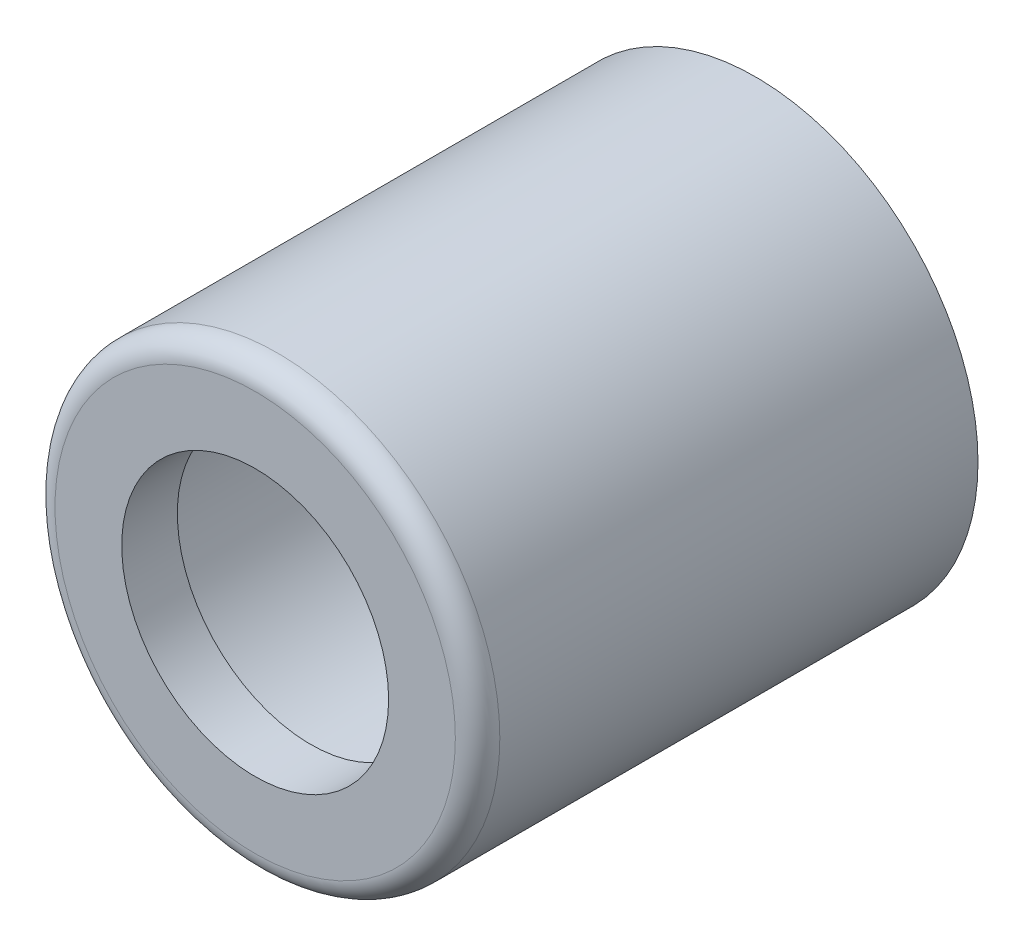
ISO-10303-21;
HEADER;
FILE_DESCRIPTION(('STEP AP214'),'2;1');
FILE_NAME('part.step','',(''),(''),'','','');
FILE_SCHEMA(('AUTOMOTIVE_DESIGN { 1 0 10303 214 1 1 1 1 }'));
ENDSEC;
DATA;
#1=APPLICATION_CONTEXT('core data for automotive mechanical design processes');
#2=APPLICATION_PROTOCOL_DEFINITION('international standard','automotive_design',2000,#1);
#3=PRODUCT_CONTEXT('',#1,'mechanical');
#4=PRODUCT('Part','Part','',(#3));
#5=PRODUCT_RELATED_PRODUCT_CATEGORY('part','',(#4));
#6=PRODUCT_DEFINITION_FORMATION('','',#4);
#7=PRODUCT_DEFINITION_CONTEXT('part definition',#1,'design');
#8=PRODUCT_DEFINITION('design','',#6,#7);
#9=PRODUCT_DEFINITION_SHAPE('','',#8);
#10=(LENGTH_UNIT() NAMED_UNIT(*) SI_UNIT(.MILLI.,.METRE.));
#11=(NAMED_UNIT(*) PLANE_ANGLE_UNIT() SI_UNIT($,.RADIAN.));
#12=(NAMED_UNIT(*) SI_UNIT($,.STERADIAN.) SOLID_ANGLE_UNIT());
#13=UNCERTAINTY_MEASURE_WITH_UNIT(LENGTH_MEASURE(1.E-05),#10,'distance_accuracy_value','');
#14=(GEOMETRIC_REPRESENTATION_CONTEXT(3) GLOBAL_UNCERTAINTY_ASSIGNED_CONTEXT((#13)) GLOBAL_UNIT_ASSIGNED_CONTEXT((#10,
#11,#12)) REPRESENTATION_CONTEXT('',''));
#15=CARTESIAN_POINT('',(0.,0.,0.));
#16=DIRECTION('',(0.,0.,1.));
#17=DIRECTION('',(1.,0.,0.));
#18=AXIS2_PLACEMENT_3D('',#15,#16,#17);
#19=CARTESIAN_POINT('',(0.,0.,0.));
#20=DIRECTION('',(0.,0.,1.));
#21=DIRECTION('',(1.,0.,0.));
#22=AXIS2_PLACEMENT_3D('',#19,#20,#21);
#23=PLANE('',#22);
#24=CARTESIAN_POINT('',(0.,0.,0.));
#25=DIRECTION('',(0.,0.,1.));
#26=DIRECTION('',(1.,0.,0.));
#27=AXIS2_PLACEMENT_3D('',#24,#25,#26);
#28=CIRCLE('',#27,10.);
#29=CARTESIAN_POINT('',(10.,0.,0.));
#30=VERTEX_POINT('',#29);
#31=EDGE_CURVE('E47',#30,#30,#28,.T.);
#32=ORIENTED_EDGE('',*,*,#31,.F.);
#33=EDGE_LOOP('',(#32));
#34=FACE_BOUND('',#33,.T.);
#35=CARTESIAN_POINT('',(0.,0.,0.));
#36=DIRECTION('',(0.,0.,1.));
#37=DIRECTION('',(1.,0.,0.));
#38=AXIS2_PLACEMENT_3D('',#35,#36,#37);
#39=CIRCLE('',#38,7.5);
#40=CARTESIAN_POINT('',(7.5,0.,0.));
#41=VERTEX_POINT('',#40);
#42=EDGE_CURVE('E51',#41,#41,#39,.T.);
#43=ORIENTED_EDGE('',*,*,#42,.T.);
#44=EDGE_LOOP('',(#43));
#45=FACE_BOUND('',#44,.T.);
#46=ADVANCED_FACE('F36',(#34,#45),#23,.F.);
#47=CARTESIAN_POINT('',(0.,0.,20.));
#48=DIRECTION('',(0.,0.,-1.));
#49=DIRECTION('',(-1.,0.,0.));
#50=AXIS2_PLACEMENT_3D('',#47,#48,#49);
#51=CYLINDRICAL_SURFACE('',#50,10.);
#52=CARTESIAN_POINT('',(0.,0.,21.5));
#53=DIRECTION('',(0.,0.,1.));
#54=DIRECTION('',(1.,0.,0.));
#55=AXIS2_PLACEMENT_3D('',#52,#53,#54);
#56=CIRCLE('',#55,10.);
#57=CARTESIAN_POINT('',(10.,0.,21.5));
#58=VERTEX_POINT('',#57);
#59=EDGE_CURVE('E10',#58,#58,#56,.F.);
#60=ORIENTED_EDGE('',*,*,#59,.T.);
#61=EDGE_LOOP('',(#60));
#62=FACE_BOUND('',#61,.T.);
#63=ORIENTED_EDGE('',*,*,#31,.T.);
#64=EDGE_LOOP('',(#63));
#65=FACE_BOUND('',#64,.T.);
#66=ADVANCED_FACE('F84',(#62,#65),#51,.T.);
#67=CARTESIAN_POINT('',(0.,0.,20.));
#68=DIRECTION('',(0.,0.,-1.));
#69=DIRECTION('',(-1.,0.,0.));
#70=AXIS2_PLACEMENT_3D('',#67,#68,#69);
#71=CYLINDRICAL_SURFACE('',#70,7.5);
#72=CARTESIAN_POINT('',(0.,0.,20.));
#73=DIRECTION('',(0.,0.,1.));
#74=DIRECTION('',(1.,0.,0.));
#75=AXIS2_PLACEMENT_3D('',#72,#73,#74);
#76=CIRCLE('',#75,7.5);
#77=CARTESIAN_POINT('',(7.5,0.,20.));
#78=VERTEX_POINT('',#77);
#79=EDGE_CURVE('E56',#78,#78,#76,.T.);
#80=ORIENTED_EDGE('',*,*,#79,.T.);
#81=EDGE_LOOP('',(#80));
#82=FACE_BOUND('',#81,.T.);
#83=ORIENTED_EDGE('',*,*,#42,.F.);
#84=EDGE_LOOP('',(#83));
#85=FACE_BOUND('',#84,.T.);
#86=ADVANCED_FACE('F81',(#82,#85),#71,.F.);
#87=CARTESIAN_POINT('',(0.,0.,20.));
#88=DIRECTION('',(0.,0.,1.));
#89=DIRECTION('',(1.,0.,0.));
#90=AXIS2_PLACEMENT_3D('',#87,#88,#89);
#91=PLANE('',#90);
#92=CARTESIAN_POINT('',(0.,0.,20.));
#93=DIRECTION('',(0.,0.,1.));
#94=DIRECTION('',(1.,0.,0.));
#95=AXIS2_PLACEMENT_3D('',#92,#93,#94);
#96=CIRCLE('',#95,6.);
#97=CARTESIAN_POINT('',(6.,0.,20.));
#98=VERTEX_POINT('',#97);
#99=EDGE_CURVE('E59',#98,#98,#96,.T.);
#100=ORIENTED_EDGE('',*,*,#99,.T.);
#101=EDGE_LOOP('',(#100));
#102=FACE_BOUND('',#101,.T.);
#103=ORIENTED_EDGE('',*,*,#79,.F.);
#104=EDGE_LOOP('',(#103));
#105=FACE_BOUND('',#104,.T.);
#106=ADVANCED_FACE('F66',(#102,#105),#91,.F.);
#107=CARTESIAN_POINT('',(0.,0.,22.5));
#108=DIRECTION('',(0.,0.,1.));
#109=DIRECTION('',(1.,0.,0.));
#110=AXIS2_PLACEMENT_3D('',#107,#108,#109);
#111=PLANE('',#110);
#112=CARTESIAN_POINT('',(0.,0.,22.5));
#113=DIRECTION('',(0.,0.,1.));
#114=DIRECTION('',(1.,0.,0.));
#115=AXIS2_PLACEMENT_3D('',#112,#113,#114);
#116=CIRCLE('',#115,9.);
#117=CARTESIAN_POINT('',(9.,0.,22.5));
#118=VERTEX_POINT('',#117);
#119=EDGE_CURVE('E43',#118,#118,#116,.T.);
#120=ORIENTED_EDGE('',*,*,#119,.T.);
#121=EDGE_LOOP('',(#120));
#122=FACE_BOUND('',#121,.T.);
#123=CARTESIAN_POINT('',(0.,0.,22.5));
#124=DIRECTION('',(0.,0.,1.));
#125=DIRECTION('',(1.,0.,0.));
#126=AXIS2_PLACEMENT_3D('',#123,#124,#125);
#127=CIRCLE('',#126,6.);
#128=CARTESIAN_POINT('',(6.,0.,22.5));
#129=VERTEX_POINT('',#128);
#130=EDGE_CURVE('E60',#129,#129,#127,.T.);
#131=ORIENTED_EDGE('',*,*,#130,.F.);
#132=EDGE_LOOP('',(#131));
#133=FACE_BOUND('',#132,.T.);
#134=ADVANCED_FACE('F72',(#122,#133),#111,.T.);
#135=CARTESIAN_POINT('',(0.,0.,20.));
#136=DIRECTION('',(0.,0.,1.));
#137=DIRECTION('',(1.,0.,0.));
#138=AXIS2_PLACEMENT_3D('',#135,#136,#137);
#139=CYLINDRICAL_SURFACE('',#138,6.);
#140=ORIENTED_EDGE('',*,*,#99,.F.);
#141=EDGE_LOOP('',(#140));
#142=FACE_BOUND('',#141,.T.);
#143=ORIENTED_EDGE('',*,*,#130,.T.);
#144=EDGE_LOOP('',(#143));
#145=FACE_BOUND('',#144,.T.);
#146=ADVANCED_FACE('F69',(#142,#145),#139,.F.);
#147=CARTESIAN_POINT('',(0.,0.,21.5));
#148=DIRECTION('',(0.,0.,1.));
#149=DIRECTION('',(1.,0.,0.));
#150=AXIS2_PLACEMENT_3D('',#147,#148,#149);
#151=TOROIDAL_SURFACE('',#150,9.,1.);
#152=ORIENTED_EDGE('',*,*,#59,.F.);
#153=EDGE_LOOP('',(#152));
#154=FACE_BOUND('',#153,.T.);
#155=ORIENTED_EDGE('',*,*,#119,.F.);
#156=EDGE_LOOP('',(#155));
#157=FACE_BOUND('',#156,.T.);
#158=ADVANCED_FACE('F38',(#154,#157),#151,.T.);
#159=CLOSED_SHELL('',(#46,#66,#86,#106,#134,#146,#158));
#160=MANIFOLD_SOLID_BREP('B2',#159);
#161=ADVANCED_BREP_SHAPE_REPRESENTATION('',(#18,#160),#14);
#162=SHAPE_DEFINITION_REPRESENTATION(#9,#161);
ENDSEC;
END-ISO-10303-21;
